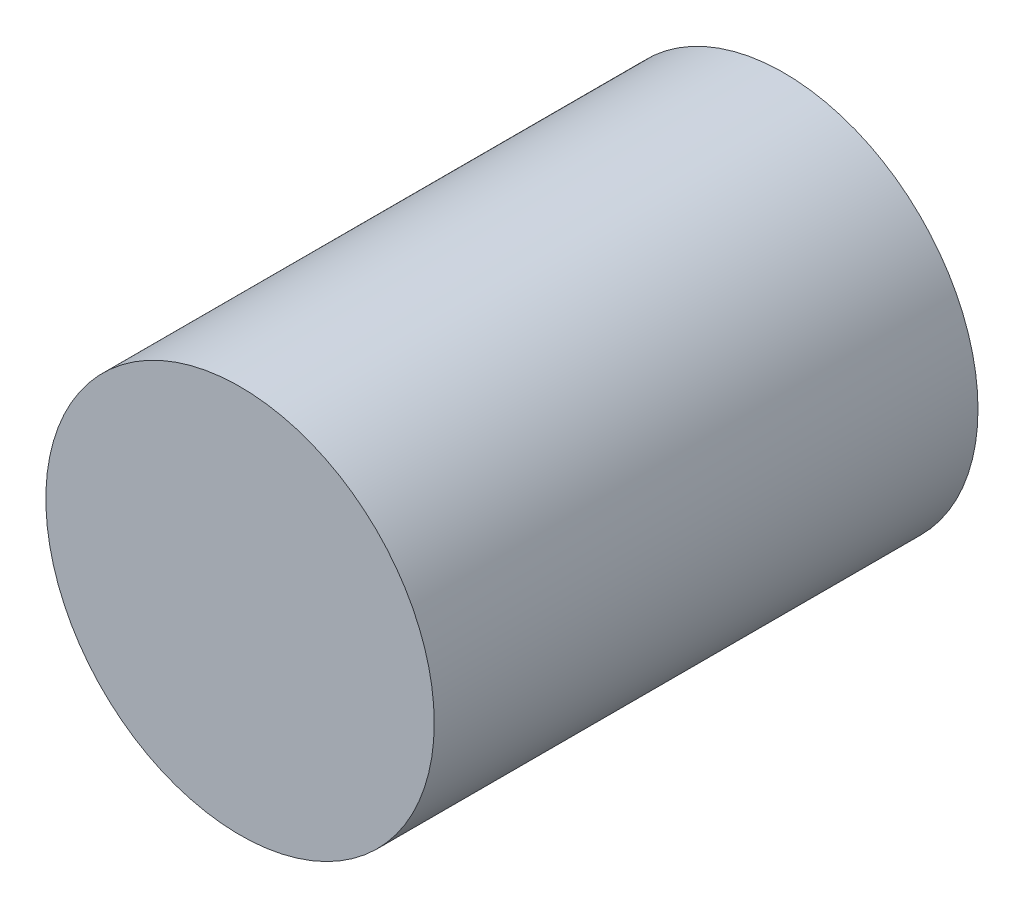
ISO-10303-21;
HEADER;
FILE_DESCRIPTION(('STEP AP214'),'2;1');
FILE_NAME('part.step','',(''),(''),'','','');
FILE_SCHEMA(('AUTOMOTIVE_DESIGN { 1 0 10303 214 1 1 1 1 }'));
ENDSEC;
DATA;
#1=APPLICATION_CONTEXT('core data for automotive mechanical design processes');
#2=APPLICATION_PROTOCOL_DEFINITION('international standard','automotive_design',2000,#1);
#3=PRODUCT_CONTEXT('',#1,'mechanical');
#4=PRODUCT('Part','Part','',(#3));
#5=PRODUCT_RELATED_PRODUCT_CATEGORY('part','',(#4));
#6=PRODUCT_DEFINITION_FORMATION('','',#4);
#7=PRODUCT_DEFINITION_CONTEXT('part definition',#1,'design');
#8=PRODUCT_DEFINITION('design','',#6,#7);
#9=PRODUCT_DEFINITION_SHAPE('','',#8);
#10=(LENGTH_UNIT() NAMED_UNIT(*) SI_UNIT(.MILLI.,.METRE.));
#11=(NAMED_UNIT(*) PLANE_ANGLE_UNIT() SI_UNIT($,.RADIAN.));
#12=(NAMED_UNIT(*) SI_UNIT($,.STERADIAN.) SOLID_ANGLE_UNIT());
#13=UNCERTAINTY_MEASURE_WITH_UNIT(LENGTH_MEASURE(1.E-05),#10,'distance_accuracy_value','');
#14=(GEOMETRIC_REPRESENTATION_CONTEXT(3) GLOBAL_UNCERTAINTY_ASSIGNED_CONTEXT((#13)) GLOBAL_UNIT_ASSIGNED_CONTEXT((#10,
#11,#12)) REPRESENTATION_CONTEXT('',''));
#15=CARTESIAN_POINT('',(0.,0.,0.));
#16=DIRECTION('',(0.,0.,1.));
#17=DIRECTION('',(1.,0.,0.));
#18=AXIS2_PLACEMENT_3D('',#15,#16,#17);
#19=CARTESIAN_POINT('',(0.,0.,0.));
#20=DIRECTION('',(0.,0.,-1.));
#21=DIRECTION('',(-1.,0.,0.));
#22=AXIS2_PLACEMENT_3D('',#19,#20,#21);
#23=PLANE('',#22);
#24=CARTESIAN_POINT('',(0.,0.,0.));
#25=DIRECTION('',(0.,0.,1.));
#26=DIRECTION('',(1.,0.,0.));
#27=AXIS2_PLACEMENT_3D('',#24,#25,#26);
#28=CIRCLE('',#27,50.);
#29=CARTESIAN_POINT('',(50.,0.,0.));
#30=VERTEX_POINT('',#29);
#31=EDGE_CURVE('E10',#30,#30,#28,.T.);
#32=ORIENTED_EDGE('',*,*,#31,.T.);
#33=EDGE_LOOP('',(#32));
#34=FACE_BOUND('',#33,.T.);
#35=ADVANCED_FACE('F30',(#34),#23,.F.);
#36=CARTESIAN_POINT('',(0.,0.,0.));
#37=DIRECTION('',(0.,0.,1.));
#38=DIRECTION('',(1.,0.,0.));
#39=AXIS2_PLACEMENT_3D('',#36,#37,#38);
#40=CYLINDRICAL_SURFACE('',#39,50.);
#41=ORIENTED_EDGE('',*,*,#31,.F.);
#42=EDGE_LOOP('',(#41));
#43=FACE_BOUND('',#42,.T.);
#44=CARTESIAN_POINT('',(0.,0.,-140.));
#45=DIRECTION('',(0.,0.,1.));
#46=DIRECTION('',(1.,0.,0.));
#47=AXIS2_PLACEMENT_3D('',#44,#45,#46);
#48=CIRCLE('',#47,50.);
#49=CARTESIAN_POINT('',(50.,0.,-140.));
#50=VERTEX_POINT('',#49);
#51=EDGE_CURVE('E36',#50,#50,#48,.T.);
#52=ORIENTED_EDGE('',*,*,#51,.T.);
#53=EDGE_LOOP('',(#52));
#54=FACE_BOUND('',#53,.T.);
#55=ADVANCED_FACE('F68',(#43,#54),#40,.T.);
#56=CARTESIAN_POINT('',(0.,50.,-140.));
#57=DIRECTION('',(0.,0.,1.));
#58=DIRECTION('',(1.,0.,0.));
#59=AXIS2_PLACEMENT_3D('',#56,#57,#58);
#60=PLANE('',#59);
#61=ORIENTED_EDGE('',*,*,#51,.F.);
#62=EDGE_LOOP('',(#61));
#63=FACE_BOUND('',#62,.T.);
#64=CARTESIAN_POINT('',(0.,0.,-140.));
#65=DIRECTION('',(0.,0.,1.));
#66=DIRECTION('',(1.,0.,0.));
#67=AXIS2_PLACEMENT_3D('',#64,#65,#66);
#68=CIRCLE('',#67,30.);
#69=CARTESIAN_POINT('',(30.,0.,-140.));
#70=VERTEX_POINT('',#69);
#71=EDGE_CURVE('E40',#70,#70,#68,.T.);
#72=ORIENTED_EDGE('',*,*,#71,.T.);
#73=EDGE_LOOP('',(#72));
#74=FACE_BOUND('',#73,.T.);
#75=ADVANCED_FACE('F72',(#63,#74),#60,.F.);
#76=CARTESIAN_POINT('',(0.,0.,0.));
#77=DIRECTION('',(0.,0.,1.));
#78=DIRECTION('',(1.,0.,0.));
#79=AXIS2_PLACEMENT_3D('',#76,#77,#78);
#80=CYLINDRICAL_SURFACE('',#79,30.);
#81=ORIENTED_EDGE('',*,*,#71,.F.);
#82=EDGE_LOOP('',(#81));
#83=FACE_BOUND('',#82,.T.);
#84=CARTESIAN_POINT('',(0.,0.,-100.));
#85=DIRECTION('',(0.,0.,1.));
#86=DIRECTION('',(1.,0.,0.));
#87=AXIS2_PLACEMENT_3D('',#84,#85,#86);
#88=CIRCLE('',#87,30.);
#89=CARTESIAN_POINT('',(30.,0.,-100.));
#90=VERTEX_POINT('',#89);
#91=EDGE_CURVE('E44',#90,#90,#88,.T.);
#92=ORIENTED_EDGE('',*,*,#91,.T.);
#93=EDGE_LOOP('',(#92));
#94=FACE_BOUND('',#93,.T.);
#95=ADVANCED_FACE('F77',(#83,#94),#80,.F.);
#96=CARTESIAN_POINT('',(0.,30.,-100.));
#97=DIRECTION('',(0.,0.,1.));
#98=DIRECTION('',(1.,0.,0.));
#99=AXIS2_PLACEMENT_3D('',#96,#97,#98);
#100=PLANE('',#99);
#101=ORIENTED_EDGE('',*,*,#91,.F.);
#102=EDGE_LOOP('',(#101));
#103=FACE_BOUND('',#102,.T.);
#104=CARTESIAN_POINT('',(0.,0.,-100.));
#105=DIRECTION('',(0.,0.,1.));
#106=DIRECTION('',(1.,0.,0.));
#107=AXIS2_PLACEMENT_3D('',#104,#105,#106);
#108=CIRCLE('',#107,10.);
#109=CARTESIAN_POINT('',(10.,0.,-100.));
#110=VERTEX_POINT('',#109);
#111=EDGE_CURVE('E49',#110,#110,#108,.T.);
#112=ORIENTED_EDGE('',*,*,#111,.T.);
#113=EDGE_LOOP('',(#112));
#114=FACE_BOUND('',#113,.T.);
#115=ADVANCED_FACE('F64',(#103,#114),#100,.F.);
#116=CARTESIAN_POINT('',(0.,0.,0.));
#117=DIRECTION('',(0.,0.,1.));
#118=DIRECTION('',(1.,0.,0.));
#119=AXIS2_PLACEMENT_3D('',#116,#117,#118);
#120=CYLINDRICAL_SURFACE('',#119,10.);
#121=ORIENTED_EDGE('',*,*,#111,.F.);
#122=EDGE_LOOP('',(#121));
#123=FACE_BOUND('',#122,.T.);
#124=CARTESIAN_POINT('',(0.,0.,-20.));
#125=DIRECTION('',(0.,0.,1.));
#126=DIRECTION('',(1.,0.,0.));
#127=AXIS2_PLACEMENT_3D('',#124,#125,#126);
#128=CIRCLE('',#127,9.99999999999999);
#129=CARTESIAN_POINT('',(9.99999999999999,0.,-20.));
#130=VERTEX_POINT('',#129);
#131=EDGE_CURVE('E52',#130,#130,#128,.T.);
#132=ORIENTED_EDGE('',*,*,#131,.T.);
#133=EDGE_LOOP('',(#132));
#134=FACE_BOUND('',#133,.T.);
#135=ADVANCED_FACE('F56',(#123,#134),#120,.F.);
#136=CARTESIAN_POINT('',(0.,9.99999999999999,-20.));
#137=DIRECTION('',(0.,0.,1.));
#138=DIRECTION('',(1.,0.,0.));
#139=AXIS2_PLACEMENT_3D('',#136,#137,#138);
#140=PLANE('',#139);
#141=ORIENTED_EDGE('',*,*,#131,.F.);
#142=EDGE_LOOP('',(#141));
#143=FACE_BOUND('',#142,.T.);
#144=ADVANCED_FACE('F58',(#143),#140,.F.);
#145=CLOSED_SHELL('',(#35,#55,#75,#95,#115,#135,#144));
#146=MANIFOLD_SOLID_BREP('B2',#145);
#147=ADVANCED_BREP_SHAPE_REPRESENTATION('',(#18,#146),#14);
#148=SHAPE_DEFINITION_REPRESENTATION(#9,#147);
ENDSEC;
END-ISO-10303-21;
